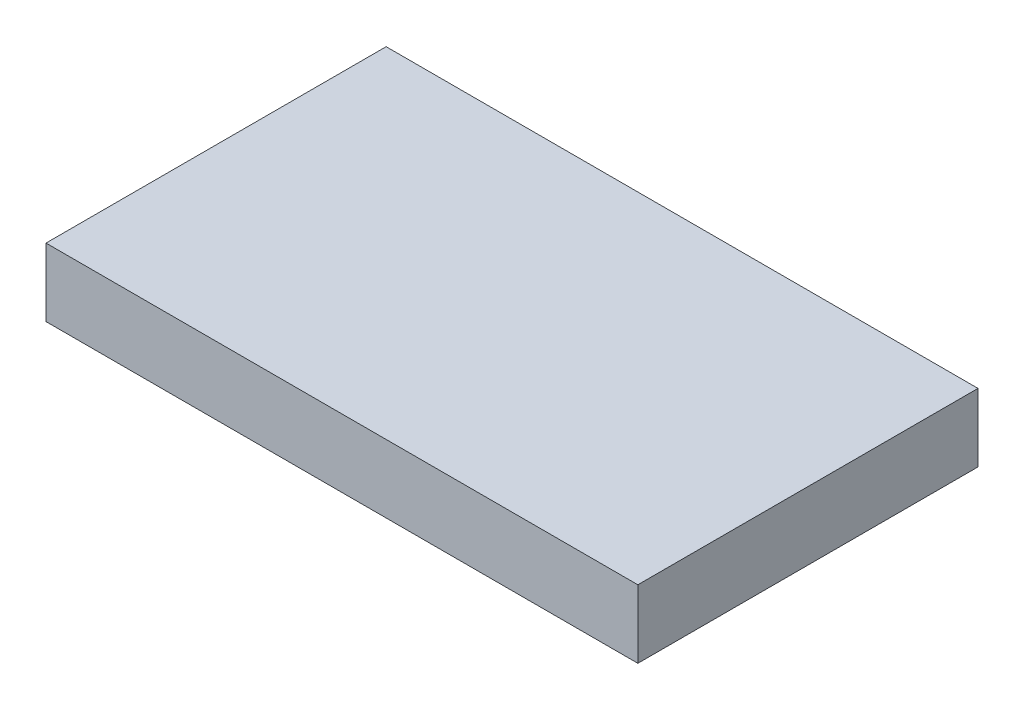
ISO-10303-21;
HEADER;
FILE_DESCRIPTION(('STEP AP214'),'2;1');
FILE_NAME('part.step','',(''),(''),'','','');
FILE_SCHEMA(('AUTOMOTIVE_DESIGN { 1 0 10303 214 1 1 1 1 }'));
ENDSEC;
DATA;
#1=APPLICATION_CONTEXT('core data for automotive mechanical design processes');
#2=APPLICATION_PROTOCOL_DEFINITION('international standard','automotive_design',2000,#1);
#3=PRODUCT_CONTEXT('',#1,'mechanical');
#4=PRODUCT('Part','Part','',(#3));
#5=PRODUCT_RELATED_PRODUCT_CATEGORY('part','',(#4));
#6=PRODUCT_DEFINITION_FORMATION('','',#4);
#7=PRODUCT_DEFINITION_CONTEXT('part definition',#1,'design');
#8=PRODUCT_DEFINITION('design','',#6,#7);
#9=PRODUCT_DEFINITION_SHAPE('','',#8);
#10=(LENGTH_UNIT() NAMED_UNIT(*) SI_UNIT(.MILLI.,.METRE.));
#11=(NAMED_UNIT(*) PLANE_ANGLE_UNIT() SI_UNIT($,.RADIAN.));
#12=(NAMED_UNIT(*) SI_UNIT($,.STERADIAN.) SOLID_ANGLE_UNIT());
#13=UNCERTAINTY_MEASURE_WITH_UNIT(LENGTH_MEASURE(1.E-05),#10,'distance_accuracy_value','');
#14=(GEOMETRIC_REPRESENTATION_CONTEXT(3) GLOBAL_UNCERTAINTY_ASSIGNED_CONTEXT((#13)) GLOBAL_UNIT_ASSIGNED_CONTEXT((#10,
#11,#12)) REPRESENTATION_CONTEXT('',''));
#15=CARTESIAN_POINT('',(0.,0.,0.));
#16=DIRECTION('',(0.,0.,1.));
#17=DIRECTION('',(1.,0.,0.));
#18=AXIS2_PLACEMENT_3D('',#15,#16,#17);
#19=CARTESIAN_POINT('',(0.,10.,0.));
#20=DIRECTION('',(0.,1.,0.));
#21=DIRECTION('',(0.,0.,1.));
#22=AXIS2_PLACEMENT_3D('',#19,#20,#21);
#23=PLANE('',#22);
#24=DIRECTION('',(-1.,0.,0.));
#25=VECTOR('',#24,1.);
#26=CARTESIAN_POINT('',(43.5,10.0000000000001,-25.));
#27=LINE('',#26,#25);
#28=CARTESIAN_POINT('',(-43.5000000000004,10.0000000000001,-25.));
#29=VERTEX_POINT('',#28);
#30=CARTESIAN_POINT('',(43.5,10.0000000000001,-25.));
#31=VERTEX_POINT('',#30);
#32=EDGE_CURVE('E67',#29,#31,#27,.F.);
#33=ORIENTED_EDGE('',*,*,#32,.F.);
#34=DIRECTION('',(0.,0.,1.));
#35=VECTOR('',#34,1.);
#36=CARTESIAN_POINT('',(-43.5000000000004,10.0000000000001,-25.));
#37=LINE('',#36,#35);
#38=CARTESIAN_POINT('',(-43.5000000000004,10.,25.));
#39=VERTEX_POINT('',#38);
#40=EDGE_CURVE('E19',#39,#29,#37,.F.);
#41=ORIENTED_EDGE('',*,*,#40,.F.);
#42=DIRECTION('',(1.,0.,0.));
#43=VECTOR('',#42,1.);
#44=CARTESIAN_POINT('',(-43.5000000000004,10.,25.));
#45=LINE('',#44,#43);
#46=CARTESIAN_POINT('',(43.5,10.,25.));
#47=VERTEX_POINT('',#46);
#48=EDGE_CURVE('E57',#47,#39,#45,.F.);
#49=ORIENTED_EDGE('',*,*,#48,.F.);
#50=DIRECTION('',(0.,0.,-1.));
#51=VECTOR('',#50,1.);
#52=CARTESIAN_POINT('',(43.5,10.,25.));
#53=LINE('',#52,#51);
#54=EDGE_CURVE('E52',#31,#47,#53,.F.);
#55=ORIENTED_EDGE('',*,*,#54,.F.);
#56=EDGE_LOOP('',(#33,#41,#49,#55));
#57=FACE_BOUND('',#56,.T.);
#58=ADVANCED_FACE('F16',(#57),#23,.T.);
#59=CARTESIAN_POINT('',(-43.5000000000004,1.94289029309402E-13,-25.));
#60=DIRECTION('',(-1.,0.,0.));
#61=DIRECTION('',(0.,0.,1.));
#62=AXIS2_PLACEMENT_3D('',#59,#60,#61);
#63=PLANE('',#62);
#64=DIRECTION('',(0.,1.,0.));
#65=VECTOR('',#64,1.);
#66=CARTESIAN_POINT('',(-43.5000000000004,1.94289029309402E-13,-25.));
#67=LINE('',#66,#65);
#68=CARTESIAN_POINT('',(-43.5000000000004,1.94289029309402E-13,-25.));
#69=VERTEX_POINT('',#68);
#70=EDGE_CURVE('E78',#69,#29,#67,.T.);
#71=ORIENTED_EDGE('',*,*,#70,.F.);
#72=DIRECTION('',(0.,0.,1.));
#73=VECTOR('',#72,1.);
#74=CARTESIAN_POINT('',(-43.5000000000004,0.,0.));
#75=LINE('',#74,#73);
#76=CARTESIAN_POINT('',(-43.5000000000004,0.,25.));
#77=VERTEX_POINT('',#76);
#78=EDGE_CURVE('E73',#69,#77,#75,.T.);
#79=ORIENTED_EDGE('',*,*,#78,.T.);
#80=DIRECTION('',(0.,1.,0.));
#81=VECTOR('',#80,1.);
#82=CARTESIAN_POINT('',(-43.5000000000004,0.,25.));
#83=LINE('',#82,#81);
#84=EDGE_CURVE('E62',#39,#77,#83,.F.);
#85=ORIENTED_EDGE('',*,*,#84,.F.);
#86=ORIENTED_EDGE('',*,*,#40,.T.);
#87=EDGE_LOOP('',(#71,#79,#85,#86));
#88=FACE_BOUND('',#87,.T.);
#89=ADVANCED_FACE('F72',(#88),#63,.T.);
#90=CARTESIAN_POINT('',(-43.5000000000004,0.,25.));
#91=DIRECTION('',(0.,0.,1.));
#92=DIRECTION('',(1.,0.,0.));
#93=AXIS2_PLACEMENT_3D('',#90,#91,#92);
#94=PLANE('',#93);
#95=ORIENTED_EDGE('',*,*,#84,.T.);
#96=DIRECTION('',(1.,0.,0.));
#97=VECTOR('',#96,1.);
#98=CARTESIAN_POINT('',(0.,0.,25.));
#99=LINE('',#98,#97);
#100=CARTESIAN_POINT('',(43.5,0.,25.));
#101=VERTEX_POINT('',#100);
#102=EDGE_CURVE('E83',#77,#101,#99,.T.);
#103=ORIENTED_EDGE('',*,*,#102,.T.);
#104=DIRECTION('',(0.,1.,0.));
#105=VECTOR('',#104,1.);
#106=CARTESIAN_POINT('',(43.5,0.,25.));
#107=LINE('',#106,#105);
#108=EDGE_CURVE('E64',#47,#101,#107,.F.);
#109=ORIENTED_EDGE('',*,*,#108,.F.);
#110=ORIENTED_EDGE('',*,*,#48,.T.);
#111=EDGE_LOOP('',(#95,#103,#109,#110));
#112=FACE_BOUND('',#111,.T.);
#113=ADVANCED_FACE('F59',(#112),#94,.T.);
#114=CARTESIAN_POINT('',(43.5,0.,25.));
#115=DIRECTION('',(1.,0.,0.));
#116=DIRECTION('',(0.,0.,-1.));
#117=AXIS2_PLACEMENT_3D('',#114,#115,#116);
#118=PLANE('',#117);
#119=ORIENTED_EDGE('',*,*,#108,.T.);
#120=DIRECTION('',(0.,0.,1.));
#121=VECTOR('',#120,1.);
#122=CARTESIAN_POINT('',(43.5,0.,0.));
#123=LINE('',#122,#121);
#124=CARTESIAN_POINT('',(43.5,1.94289029309402E-13,-25.));
#125=VERTEX_POINT('',#124);
#126=EDGE_CURVE('E25',#101,#125,#123,.F.);
#127=ORIENTED_EDGE('',*,*,#126,.T.);
#128=DIRECTION('',(0.,1.,0.));
#129=VECTOR('',#128,1.);
#130=CARTESIAN_POINT('',(43.5,1.94289029309402E-13,-25.));
#131=LINE('',#130,#129);
#132=EDGE_CURVE('E33',#31,#125,#131,.F.);
#133=ORIENTED_EDGE('',*,*,#132,.F.);
#134=ORIENTED_EDGE('',*,*,#54,.T.);
#135=EDGE_LOOP('',(#119,#127,#133,#134));
#136=FACE_BOUND('',#135,.T.);
#137=ADVANCED_FACE('F87',(#136),#118,.T.);
#138=CARTESIAN_POINT('',(43.5,1.94289029309402E-13,-25.));
#139=DIRECTION('',(0.,0.,-1.));
#140=DIRECTION('',(-1.,0.,0.));
#141=AXIS2_PLACEMENT_3D('',#138,#139,#140);
#142=PLANE('',#141);
#143=ORIENTED_EDGE('',*,*,#132,.T.);
#144=DIRECTION('',(1.,0.,0.));
#145=VECTOR('',#144,1.);
#146=CARTESIAN_POINT('',(0.,1.94289029309402E-13,-25.));
#147=LINE('',#146,#145);
#148=EDGE_CURVE('E11',#125,#69,#147,.F.);
#149=ORIENTED_EDGE('',*,*,#148,.T.);
#150=ORIENTED_EDGE('',*,*,#70,.T.);
#151=ORIENTED_EDGE('',*,*,#32,.T.);
#152=EDGE_LOOP('',(#143,#149,#150,#151));
#153=FACE_BOUND('',#152,.T.);
#154=ADVANCED_FACE('F90',(#153),#142,.T.);
#155=CARTESIAN_POINT('',(0.,0.,0.));
#156=DIRECTION('',(0.,1.,0.));
#157=DIRECTION('',(0.,0.,1.));
#158=AXIS2_PLACEMENT_3D('',#155,#156,#157);
#159=PLANE('',#158);
#160=ORIENTED_EDGE('',*,*,#126,.F.);
#161=ORIENTED_EDGE('',*,*,#102,.F.);
#162=ORIENTED_EDGE('',*,*,#78,.F.);
#163=ORIENTED_EDGE('',*,*,#148,.F.);
#164=EDGE_LOOP('',(#160,#161,#162,#163));
#165=FACE_BOUND('',#164,.T.);
#166=ADVANCED_FACE('F89',(#165),#159,.F.);
#167=CLOSED_SHELL('',(#58,#89,#113,#137,#154,#166));
#168=MANIFOLD_SOLID_BREP('B1',#167);
#169=ADVANCED_BREP_SHAPE_REPRESENTATION('',(#18,#168),#14);
#170=SHAPE_DEFINITION_REPRESENTATION(#9,#169);
ENDSEC;
END-ISO-10303-21;
